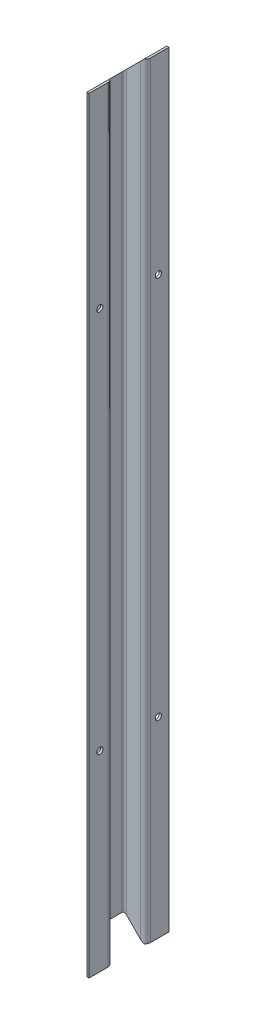
ISO-10303-21;
HEADER;
FILE_DESCRIPTION(('STEP AP214'),'2;1');
FILE_NAME('part.step','',(''),(''),'','','');
FILE_SCHEMA(('AUTOMOTIVE_DESIGN { 1 0 10303 214 1 1 1 1 }'));
ENDSEC;
DATA;
#1=APPLICATION_CONTEXT('core data for automotive mechanical design processes');
#2=APPLICATION_PROTOCOL_DEFINITION('international standard','automotive_design',2000,#1);
#3=PRODUCT_CONTEXT('',#1,'mechanical');
#4=PRODUCT('Part','Part','',(#3));
#5=PRODUCT_RELATED_PRODUCT_CATEGORY('part','',(#4));
#6=PRODUCT_DEFINITION_FORMATION('','',#4);
#7=PRODUCT_DEFINITION_CONTEXT('part definition',#1,'design');
#8=PRODUCT_DEFINITION('design','',#6,#7);
#9=PRODUCT_DEFINITION_SHAPE('','',#8);
#10=(LENGTH_UNIT() NAMED_UNIT(*) SI_UNIT(.MILLI.,.METRE.));
#11=(NAMED_UNIT(*) PLANE_ANGLE_UNIT() SI_UNIT($,.RADIAN.));
#12=(NAMED_UNIT(*) SI_UNIT($,.STERADIAN.) SOLID_ANGLE_UNIT());
#13=UNCERTAINTY_MEASURE_WITH_UNIT(LENGTH_MEASURE(1.E-05),#10,'distance_accuracy_value','');
#14=(GEOMETRIC_REPRESENTATION_CONTEXT(3) GLOBAL_UNCERTAINTY_ASSIGNED_CONTEXT((#13)) GLOBAL_UNIT_ASSIGNED_CONTEXT((#10,
#11,#12)) REPRESENTATION_CONTEXT('',''));
#15=CARTESIAN_POINT('',(0.,0.,0.));
#16=DIRECTION('',(0.,0.,1.));
#17=DIRECTION('',(1.,0.,0.));
#18=AXIS2_PLACEMENT_3D('',#15,#16,#17);
#19=CARTESIAN_POINT('',(12.7,-914.4,-450.975716114044));
#20=DIRECTION('',(0.,0.,1.));
#21=DIRECTION('',(1.,0.,0.));
#22=AXIS2_PLACEMENT_3D('',#19,#20,#21);
#23=PLANE('',#22);
#24=DIRECTION('',(-0.707106781186547,0.707106781186548,0.));
#25=VECTOR('',#24,1.);
#26=CARTESIAN_POINT('',(11.5321843035207,-900.532184303521,-450.975716114044));
#27=LINE('',#26,#25);
#28=CARTESIAN_POINT('',(22.8092,-911.8092,-450.975716114044));
#29=VERTEX_POINT('',#28);
#30=CARTESIAN_POINT('',(5.7658,-894.7658,-450.975716114044));
#31=VERTEX_POINT('',#30);
#32=EDGE_CURVE('E371',#29,#31,#27,.T.);
#33=ORIENTED_EDGE('',*,*,#32,.F.);
#34=DIRECTION('',(0.,1.,0.));
#35=VECTOR('',#34,1.);
#36=CARTESIAN_POINT('',(22.8092,0.,-450.975716114044));
#37=LINE('',#36,#35);
#38=CARTESIAN_POINT('',(22.8092,-2.5908,-450.975716114044));
#39=VERTEX_POINT('',#38);
#40=EDGE_CURVE('E294',#29,#39,#37,.T.);
#41=ORIENTED_EDGE('',*,*,#40,.T.);
#42=DIRECTION('',(-0.707106781186548,-0.707106781186548,0.));
#43=VECTOR('',#42,1.);
#44=CARTESIAN_POINT('',(7.8140222492642,-17.5859777507358,-450.975716114044));
#45=LINE('',#44,#43);
#46=CARTESIAN_POINT('',(5.7658,-19.6342,-450.975716114044));
#47=VERTEX_POINT('',#46);
#48=EDGE_CURVE('E359',#39,#47,#45,.T.);
#49=ORIENTED_EDGE('',*,*,#48,.T.);
#50=DIRECTION('',(0.,1.,0.));
#51=VECTOR('',#50,1.);
#52=CARTESIAN_POINT('',(5.7658,-914.4,-450.975716114044));
#53=LINE('',#52,#51);
#54=EDGE_CURVE('E242',#47,#31,#53,.F.);
#55=ORIENTED_EDGE('',*,*,#54,.T.);
#56=EDGE_LOOP('',(#33,#41,#49,#55));
#57=FACE_BOUND('',#56,.T.);
#58=ADVANCED_FACE('F14',(#57),#23,.T.);
#59=CARTESIAN_POINT('',(0.,-914.4,-473.200716114044));
#60=DIRECTION('',(1.,0.,0.));
#61=DIRECTION('',(0.,0.,-1.));
#62=AXIS2_PLACEMENT_3D('',#59,#60,#61);
#63=PLANE('',#62);
#64=DIRECTION('',(0.,1.,0.));
#65=VECTOR('',#64,1.);
#66=CARTESIAN_POINT('',(0.,0.,-456.741516114044));
#67=LINE('',#66,#65);
#68=CARTESIAN_POINT('',(0.,-889.,-456.741516114044));
#69=VERTEX_POINT('',#68);
#70=CARTESIAN_POINT('',(0.,-25.4,-456.741516114044));
#71=VERTEX_POINT('',#70);
#72=EDGE_CURVE('E480',#69,#71,#67,.T.);
#73=ORIENTED_EDGE('',*,*,#72,.T.);
#74=DIRECTION('',(0.,0.,-1.));
#75=VECTOR('',#74,1.);
#76=CARTESIAN_POINT('',(0.,-25.4,-450.975716114044));
#77=LINE('',#76,#75);
#78=CARTESIAN_POINT('',(0.,-25.4,-489.659916114044));
#79=VERTEX_POINT('',#78);
#80=EDGE_CURVE('E362',#71,#79,#77,.T.);
#81=ORIENTED_EDGE('',*,*,#80,.T.);
#82=DIRECTION('',(0.,1.,0.));
#83=VECTOR('',#82,1.);
#84=CARTESIAN_POINT('',(0.,-914.4,-489.659916114044));
#85=LINE('',#84,#83);
#86=CARTESIAN_POINT('',(0.,-889.,-489.659916114044));
#87=VERTEX_POINT('',#86);
#88=EDGE_CURVE('E476',#79,#87,#85,.F.);
#89=ORIENTED_EDGE('',*,*,#88,.T.);
#90=DIRECTION('',(0.,0.,-1.));
#91=VECTOR('',#90,1.);
#92=CARTESIAN_POINT('',(0.,-889.,-450.975716114044));
#93=LINE('',#92,#91);
#94=EDGE_CURVE('E374',#69,#87,#93,.T.);
#95=ORIENTED_EDGE('',*,*,#94,.F.);
#96=EDGE_LOOP('',(#73,#81,#89,#95));
#97=FACE_BOUND('',#96,.T.);
#98=ADVANCED_FACE('F533',(#97),#63,.F.);
#99=CARTESIAN_POINT('',(12.7,-914.4,-495.425716114044));
#100=DIRECTION('',(0.,0.,1.));
#101=DIRECTION('',(1.,0.,0.));
#102=AXIS2_PLACEMENT_3D('',#99,#100,#101);
#103=PLANE('',#102);
#104=DIRECTION('',(-0.707106781186548,-0.707106781186548,0.));
#105=VECTOR('',#104,1.);
#106=CARTESIAN_POINT('',(7.8140222492642,-17.5859777507358,-495.425716114044));
#107=LINE('',#106,#105);
#108=CARTESIAN_POINT('',(22.8092,-2.5908,-495.425716114044));
#109=VERTEX_POINT('',#108);
#110=CARTESIAN_POINT('',(5.7658,-19.6342,-495.425716114044));
#111=VERTEX_POINT('',#110);
#112=EDGE_CURVE('E232',#109,#111,#107,.T.);
#113=ORIENTED_EDGE('',*,*,#112,.F.);
#114=DIRECTION('',(0.,1.,0.));
#115=VECTOR('',#114,1.);
#116=CARTESIAN_POINT('',(22.8092,-914.4,-495.425716114044));
#117=LINE('',#116,#115);
#118=CARTESIAN_POINT('',(22.8092,-911.8092,-495.425716114044));
#119=VERTEX_POINT('',#118);
#120=EDGE_CURVE('E277',#109,#119,#117,.F.);
#121=ORIENTED_EDGE('',*,*,#120,.T.);
#122=DIRECTION('',(-0.707106781186547,0.707106781186548,0.));
#123=VECTOR('',#122,1.);
#124=CARTESIAN_POINT('',(11.5321843035207,-900.532184303521,-495.425716114044));
#125=LINE('',#124,#123);
#126=CARTESIAN_POINT('',(5.7658,-894.7658,-495.425716114044));
#127=VERTEX_POINT('',#126);
#128=EDGE_CURVE('E327',#119,#127,#125,.T.);
#129=ORIENTED_EDGE('',*,*,#128,.T.);
#130=DIRECTION('',(0.,1.,0.));
#131=VECTOR('',#130,1.);
#132=CARTESIAN_POINT('',(5.7658,-914.4,-495.425716114044));
#133=LINE('',#132,#131);
#134=EDGE_CURVE('E249',#127,#111,#133,.T.);
#135=ORIENTED_EDGE('',*,*,#134,.T.);
#136=EDGE_LOOP('',(#113,#121,#129,#135));
#137=FACE_BOUND('',#136,.T.);
#138=ADVANCED_FACE('F524',(#137),#103,.F.);
#139=CARTESIAN_POINT('',(26.6954,-914.4,-492.824756114044));
#140=DIRECTION('',(0.,0.,1.));
#141=DIRECTION('',(1.,0.,0.));
#142=AXIS2_PLACEMENT_3D('',#139,#140,#141);
#143=PLANE('',#142);
#144=DIRECTION('',(0.707106781186548,0.707106781186547,0.));
#145=VECTOR('',#144,1.);
#146=CARTESIAN_POINT('',(-431.1523,-456.5523,-492.824756114044));
#147=LINE('',#146,#145);
#148=CARTESIAN_POINT('',(5.19175999999988,-20.20824,-492.824756114044));
#149=VERTEX_POINT('',#148);
#150=CARTESIAN_POINT('',(22.225,-3.17499999999988,-492.824756114044));
#151=VERTEX_POINT('',#150);
#152=EDGE_CURVE('E407',#149,#151,#147,.T.);
#153=ORIENTED_EDGE('',*,*,#152,.F.);
#154=DIRECTION('',(0.,1.,0.));
#155=VECTOR('',#154,1.);
#156=CARTESIAN_POINT('',(5.19176,-891.60096,-492.824756114044));
#157=LINE('',#156,#155);
#158=CARTESIAN_POINT('',(5.19176,-894.19176,-492.824756114044));
#159=VERTEX_POINT('',#158);
#160=EDGE_CURVE('E287',#149,#159,#157,.F.);
#161=ORIENTED_EDGE('',*,*,#160,.T.);
#162=DIRECTION('',(0.707106781186547,-0.707106781186548,0.));
#163=VECTOR('',#162,1.);
#164=CARTESIAN_POINT('',(26.0477,-915.0477,-492.824756114044));
#165=LINE('',#164,#163);
#166=CARTESIAN_POINT('',(22.225,-911.225,-492.824756114044));
#167=VERTEX_POINT('',#166);
#168=EDGE_CURVE('E385',#159,#167,#165,.T.);
#169=ORIENTED_EDGE('',*,*,#168,.T.);
#170=DIRECTION('',(0.,1.,0.));
#171=VECTOR('',#170,1.);
#172=CARTESIAN_POINT('',(22.225,-914.4,-492.824756114044));
#173=LINE('',#172,#171);
#174=EDGE_CURVE('E260',#167,#151,#173,.T.);
#175=ORIENTED_EDGE('',*,*,#174,.T.);
#176=EDGE_LOOP('',(#153,#161,#169,#175));
#177=FACE_BOUND('',#176,.T.);
#178=ADVANCED_FACE('F625',(#177),#143,.T.);
#179=CARTESIAN_POINT('',(2.60096,-914.4,-473.200716114044));
#180=DIRECTION('',(1.,0.,0.));
#181=DIRECTION('',(0.,0.,-1.));
#182=AXIS2_PLACEMENT_3D('',#179,#180,#181);
#183=PLANE('',#182);
#184=DIRECTION('',(0.,0.,-1.));
#185=VECTOR('',#184,1.);
#186=CARTESIAN_POINT('',(2.60096,-891.60096,-473.200716114044));
#187=LINE('',#186,#185);
#188=CARTESIAN_POINT('',(2.60096,-891.60096,-456.167476114044));
#189=VERTEX_POINT('',#188);
#190=CARTESIAN_POINT('',(2.60096,-891.60096,-490.233956114044));
#191=VERTEX_POINT('',#190);
#192=EDGE_CURVE('E381',#189,#191,#187,.T.);
#193=ORIENTED_EDGE('',*,*,#192,.T.);
#194=DIRECTION('',(0.,1.,0.));
#195=VECTOR('',#194,1.);
#196=CARTESIAN_POINT('',(2.60096,-22.79904,-490.233956114044));
#197=LINE('',#196,#195);
#198=CARTESIAN_POINT('',(2.60096,-22.79904,-490.233956114044));
#199=VERTEX_POINT('',#198);
#200=EDGE_CURVE('E283',#191,#199,#197,.T.);
#201=ORIENTED_EDGE('',*,*,#200,.T.);
#202=DIRECTION('',(0.,0.,-1.));
#203=VECTOR('',#202,1.);
#204=CARTESIAN_POINT('',(2.60096,-22.79904,-473.200716114044));
#205=LINE('',#204,#203);
#206=CARTESIAN_POINT('',(2.60096,-22.79904,-456.167476114044));
#207=VERTEX_POINT('',#206);
#208=EDGE_CURVE('E403',#207,#199,#205,.T.);
#209=ORIENTED_EDGE('',*,*,#208,.F.);
#210=DIRECTION('',(0.,1.,0.));
#211=VECTOR('',#210,1.);
#212=CARTESIAN_POINT('',(2.60096,-914.4,-456.167476114044));
#213=LINE('',#212,#211);
#214=EDGE_CURVE('E280',#207,#189,#213,.F.);
#215=ORIENTED_EDGE('',*,*,#214,.T.);
#216=EDGE_LOOP('',(#193,#201,#209,#215));
#217=FACE_BOUND('',#216,.T.);
#218=ADVANCED_FACE('F619',(#217),#183,.T.);
#219=CARTESIAN_POINT('',(14.00048,-914.4,-453.576676114044));
#220=DIRECTION('',(0.,0.,1.));
#221=DIRECTION('',(1.,0.,0.));
#222=AXIS2_PLACEMENT_3D('',#219,#220,#221);
#223=PLANE('',#222);
#224=DIRECTION('',(0.707106781186547,-0.707106781186548,0.));
#225=VECTOR('',#224,1.);
#226=CARTESIAN_POINT('',(19.70024,-908.70024,-453.576676114044));
#227=LINE('',#226,#225);
#228=CARTESIAN_POINT('',(5.19176,-894.19176,-453.576676114044));
#229=VERTEX_POINT('',#228);
#230=CARTESIAN_POINT('',(22.225,-911.225,-453.576676114044));
#231=VERTEX_POINT('',#230);
#232=EDGE_CURVE('E213',#229,#231,#227,.T.);
#233=ORIENTED_EDGE('',*,*,#232,.F.);
#234=DIRECTION('',(0.,1.,0.));
#235=VECTOR('',#234,1.);
#236=CARTESIAN_POINT('',(5.19176,-914.4,-453.576676114044));
#237=LINE('',#236,#235);
#238=CARTESIAN_POINT('',(5.19175999999988,-20.20824,-453.576676114044));
#239=VERTEX_POINT('',#238);
#240=EDGE_CURVE('E290',#229,#239,#237,.T.);
#241=ORIENTED_EDGE('',*,*,#240,.T.);
#242=DIRECTION('',(0.707106781186548,0.707106781186547,0.));
#243=VECTOR('',#242,1.);
#244=CARTESIAN_POINT('',(-437.49976,-462.89976,-453.576676114044));
#245=LINE('',#244,#243);
#246=CARTESIAN_POINT('',(22.225,-3.17499999999982,-453.576676114044));
#247=VERTEX_POINT('',#246);
#248=EDGE_CURVE('E400',#239,#247,#245,.T.);
#249=ORIENTED_EDGE('',*,*,#248,.T.);
#250=DIRECTION('',(0.,1.,0.));
#251=VECTOR('',#250,1.);
#252=CARTESIAN_POINT('',(22.225,-914.4,-453.576676114044));
#253=LINE('',#252,#251);
#254=EDGE_CURVE('E220',#247,#231,#253,.F.);
#255=ORIENTED_EDGE('',*,*,#254,.T.);
#256=EDGE_LOOP('',(#233,#241,#249,#255));
#257=FACE_BOUND('',#256,.T.);
#258=ADVANCED_FACE('F615',(#257),#223,.F.);
#259=CARTESIAN_POINT('',(13.9954,-914.4,-473.200716114044));
#260=DIRECTION('',(0.,-1.,0.));
#261=DIRECTION('',(1.,0.,0.));
#262=AXIS2_PLACEMENT_3D('',#259,#260,#261);
#263=PLANE('',#262);
#264=DIRECTION('',(0.,0.,1.));
#265=VECTOR('',#264,1.);
#266=CARTESIAN_POINT('',(25.4,-914.4,-438.275716114044));
#267=LINE('',#266,#265);
#268=CARTESIAN_POINT('',(25.4,-914.4,-448.384916114044));
#269=VERTEX_POINT('',#268);
#270=CARTESIAN_POINT('',(25.4,-914.4,-425.575716114044));
#271=VERTEX_POINT('',#270);
#272=EDGE_CURVE('E229',#269,#271,#267,.T.);
#273=ORIENTED_EDGE('',*,*,#272,.F.);
#274=DIRECTION('',(0.,0.,-1.));
#275=VECTOR('',#274,1.);
#276=CARTESIAN_POINT('',(25.4,-914.4,-450.975716114044));
#277=LINE('',#276,#275);
#278=CARTESIAN_POINT('',(25.4,-914.4,-452.623757230382));
#279=VERTEX_POINT('',#278);
#280=EDGE_CURVE('E210',#269,#279,#277,.T.);
#281=ORIENTED_EDGE('',*,*,#280,.T.);
#282=CARTESIAN_POINT('',(22.225,-914.4,-447.810876114044));
#283=DIRECTION('',(0.,-1.,0.));
#284=DIRECTION('',(0.,0.,-1.));
#285=AXIS2_PLACEMENT_3D('',#282,#283,#284);
#286=CIRCLE('',#285,5.7658);
#287=CARTESIAN_POINT('',(27.9908,-914.4,-447.810876114044));
#288=VERTEX_POINT('',#287);
#289=EDGE_CURVE('E226',#279,#288,#286,.T.);
#290=ORIENTED_EDGE('',*,*,#289,.T.);
#291=DIRECTION('',(0.,0.,-1.));
#292=VECTOR('',#291,1.);
#293=CARTESIAN_POINT('',(27.9908,-914.4,-439.576196114044));
#294=LINE('',#293,#292);
#295=CARTESIAN_POINT('',(27.9908,-914.4,-425.575716114044));
#296=VERTEX_POINT('',#295);
#297=EDGE_CURVE('E433',#296,#288,#294,.T.);
#298=ORIENTED_EDGE('',*,*,#297,.F.);
#299=DIRECTION('',(1.,0.,0.));
#300=VECTOR('',#299,1.);
#301=CARTESIAN_POINT('',(26.6954,-914.4,-425.575716114044));
#302=LINE('',#301,#300);
#303=EDGE_CURVE('E436',#271,#296,#302,.T.);
#304=ORIENTED_EDGE('',*,*,#303,.F.);
#305=EDGE_LOOP('',(#273,#281,#290,#298,#304));
#306=FACE_BOUND('',#305,.T.);
#307=ADVANCED_FACE('F224',(#306),#263,.T.);
#308=CARTESIAN_POINT('',(22.225,-914.4,-498.590556114044));
#309=DIRECTION('',(0.,-1.,0.));
#310=DIRECTION('',(0.,0.,-1.));
#311=AXIS2_PLACEMENT_3D('',#308,#309,#310);
#312=CIRCLE('',#311,5.7658);
#313=CARTESIAN_POINT('',(27.9908,-914.4,-498.590556114044));
#314=VERTEX_POINT('',#313);
#315=CARTESIAN_POINT('',(25.4,-914.4,-493.777674997707));
#316=VERTEX_POINT('',#315);
#317=EDGE_CURVE('E241',#314,#316,#312,.T.);
#318=ORIENTED_EDGE('',*,*,#317,.T.);
#319=CARTESIAN_POINT('',(25.4,-914.4,-498.016516114044));
#320=VERTEX_POINT('',#319);
#321=EDGE_CURVE('E233',#316,#320,#277,.T.);
#322=ORIENTED_EDGE('',*,*,#321,.T.);
#323=DIRECTION('',(0.,0.,1.));
#324=VECTOR('',#323,1.);
#325=CARTESIAN_POINT('',(25.4,-914.4,-508.125716114044));
#326=LINE('',#325,#324);
#327=CARTESIAN_POINT('',(25.4,-914.4,-520.825716114044));
#328=VERTEX_POINT('',#327);
#329=EDGE_CURVE('E421',#328,#320,#326,.T.);
#330=ORIENTED_EDGE('',*,*,#329,.F.);
#331=DIRECTION('',(-1.,0.,0.));
#332=VECTOR('',#331,1.);
#333=CARTESIAN_POINT('',(26.6954,-914.4,-520.825716114044));
#334=LINE('',#333,#332);
#335=CARTESIAN_POINT('',(27.9908,-914.4,-520.825716114044));
#336=VERTEX_POINT('',#335);
#337=EDGE_CURVE('E425',#336,#328,#334,.T.);
#338=ORIENTED_EDGE('',*,*,#337,.F.);
#339=DIRECTION('',(0.,0.,-1.));
#340=VECTOR('',#339,1.);
#341=CARTESIAN_POINT('',(27.9908,-914.4,-506.825236114044));
#342=LINE('',#341,#340);
#343=EDGE_CURVE('E430',#314,#336,#342,.T.);
#344=ORIENTED_EDGE('',*,*,#343,.F.);
#345=EDGE_LOOP('',(#318,#322,#330,#338,#344));
#346=FACE_BOUND('',#345,.T.);
#347=ADVANCED_FACE('F505',(#346),#263,.T.);
#348=CARTESIAN_POINT('',(13.9954,0.,-473.200716114044));
#349=DIRECTION('',(0.,-1.,0.));
#350=DIRECTION('',(1.,0.,0.));
#351=AXIS2_PLACEMENT_3D('',#348,#349,#350);
#352=PLANE('',#351);
#353=DIRECTION('',(0.,0.,-1.));
#354=VECTOR('',#353,1.);
#355=CARTESIAN_POINT('',(25.4,0.,-450.975716114044));
#356=LINE('',#355,#354);
#357=CARTESIAN_POINT('',(25.4,0.,-448.384916114044));
#358=VERTEX_POINT('',#357);
#359=CARTESIAN_POINT('',(25.4,0.,-452.623757230382));
#360=VERTEX_POINT('',#359);
#361=EDGE_CURVE('E38',#358,#360,#356,.T.);
#362=ORIENTED_EDGE('',*,*,#361,.F.);
#363=DIRECTION('',(0.,0.,1.));
#364=VECTOR('',#363,1.);
#365=CARTESIAN_POINT('',(25.4,0.,-438.275716114044));
#366=LINE('',#365,#364);
#367=CARTESIAN_POINT('',(25.4,0.,-425.575716114044));
#368=VERTEX_POINT('',#367);
#369=EDGE_CURVE('E426',#358,#368,#366,.T.);
#370=ORIENTED_EDGE('',*,*,#369,.T.);
#371=DIRECTION('',(1.,0.,0.));
#372=VECTOR('',#371,1.);
#373=CARTESIAN_POINT('',(26.6954,0.,-425.575716114044));
#374=LINE('',#373,#372);
#375=CARTESIAN_POINT('',(27.9908,0.,-425.575716114044));
#376=VERTEX_POINT('',#375);
#377=EDGE_CURVE('E457',#368,#376,#374,.T.);
#378=ORIENTED_EDGE('',*,*,#377,.T.);
#379=DIRECTION('',(0.,0.,-1.));
#380=VECTOR('',#379,1.);
#381=CARTESIAN_POINT('',(27.9908,0.,-439.576196114044));
#382=LINE('',#381,#380);
#383=CARTESIAN_POINT('',(27.9908,0.,-447.810876114044));
#384=VERTEX_POINT('',#383);
#385=EDGE_CURVE('E453',#376,#384,#382,.T.);
#386=ORIENTED_EDGE('',*,*,#385,.T.);
#387=CARTESIAN_POINT('',(22.225,0.,-447.810876114044));
#388=DIRECTION('',(0.,-1.,0.));
#389=DIRECTION('',(0.,0.,-1.));
#390=AXIS2_PLACEMENT_3D('',#387,#388,#389);
#391=CIRCLE('',#390,5.7658);
#392=EDGE_CURVE('E484',#384,#360,#391,.F.);
#393=ORIENTED_EDGE('',*,*,#392,.T.);
#394=EDGE_LOOP('',(#362,#370,#378,#386,#393));
#395=FACE_BOUND('',#394,.T.);
#396=ADVANCED_FACE('F562',(#395),#352,.F.);
#397=CARTESIAN_POINT('',(25.4,0.,-493.777674997706));
#398=VERTEX_POINT('',#397);
#399=CARTESIAN_POINT('',(25.4,0.,-498.016516114044));
#400=VERTEX_POINT('',#399);
#401=EDGE_CURVE('E368',#398,#400,#356,.T.);
#402=ORIENTED_EDGE('',*,*,#401,.F.);
#403=CARTESIAN_POINT('',(22.225,0.,-498.590556114044));
#404=DIRECTION('',(0.,-1.,0.));
#405=DIRECTION('',(0.,0.,-1.));
#406=AXIS2_PLACEMENT_3D('',#403,#404,#405);
#407=CIRCLE('',#406,5.7658);
#408=CARTESIAN_POINT('',(27.9908,0.,-498.590556114044));
#409=VERTEX_POINT('',#408);
#410=EDGE_CURVE('E253',#398,#409,#407,.F.);
#411=ORIENTED_EDGE('',*,*,#410,.T.);
#412=DIRECTION('',(0.,0.,-1.));
#413=VECTOR('',#412,1.);
#414=CARTESIAN_POINT('',(27.9908,0.,-506.825236114044));
#415=LINE('',#414,#413);
#416=CARTESIAN_POINT('',(27.9908,0.,-520.825716114044));
#417=VERTEX_POINT('',#416);
#418=EDGE_CURVE('E450',#409,#417,#415,.T.);
#419=ORIENTED_EDGE('',*,*,#418,.T.);
#420=DIRECTION('',(-1.,0.,0.));
#421=VECTOR('',#420,1.);
#422=CARTESIAN_POINT('',(26.6954,0.,-520.825716114044));
#423=LINE('',#422,#421);
#424=CARTESIAN_POINT('',(25.4,0.,-520.825716114044));
#425=VERTEX_POINT('',#424);
#426=EDGE_CURVE('E446',#417,#425,#423,.T.);
#427=ORIENTED_EDGE('',*,*,#426,.T.);
#428=DIRECTION('',(0.,0.,1.));
#429=VECTOR('',#428,1.);
#430=CARTESIAN_POINT('',(25.4,0.,-508.125716114044));
#431=LINE('',#430,#429);
#432=EDGE_CURVE('E420',#425,#400,#431,.T.);
#433=ORIENTED_EDGE('',*,*,#432,.T.);
#434=EDGE_LOOP('',(#402,#411,#419,#427,#433));
#435=FACE_BOUND('',#434,.T.);
#436=ADVANCED_FACE('F491',(#435),#352,.F.);
#437=CARTESIAN_POINT('',(5.7658,-914.4,-456.741516114044));
#438=DIRECTION('',(0.,-1.,0.));
#439=DIRECTION('',(0.,0.,-1.));
#440=AXIS2_PLACEMENT_3D('',#437,#438,#439);
#441=CYLINDRICAL_SURFACE('',#440,5.7658);
#442=CARTESIAN_POINT('',(5.7658,-19.6342,-456.741516114044));
#443=DIRECTION('',(0.707106781186547,-0.707106781186548,0.));
#444=DIRECTION('',(-0.707106781186548,-0.707106781186548,0.));
#445=AXIS2_PLACEMENT_3D('',#442,#443,#444);
#446=ELLIPSE('',#445,8.15407255793079,5.7658);
#447=EDGE_CURVE('E416',#71,#47,#446,.F.);
#448=ORIENTED_EDGE('',*,*,#447,.F.);
#449=ORIENTED_EDGE('',*,*,#72,.F.);
#450=CARTESIAN_POINT('',(5.7658,-894.7658,-456.741516114044));
#451=DIRECTION('',(-0.707106781186548,-0.707106781186547,0.));
#452=DIRECTION('',(0.707106781186547,-0.707106781186548,0.));
#453=AXIS2_PLACEMENT_3D('',#450,#451,#452);
#454=ELLIPSE('',#453,8.1540725579308,5.7658);
#455=EDGE_CURVE('E396',#69,#31,#454,.F.);
#456=ORIENTED_EDGE('',*,*,#455,.T.);
#457=ORIENTED_EDGE('',*,*,#54,.F.);
#458=EDGE_LOOP('',(#448,#449,#456,#457));
#459=FACE_BOUND('',#458,.T.);
#460=ADVANCED_FACE('F537',(#459),#441,.T.);
#461=CARTESIAN_POINT('',(5.7658,-914.4,-489.659916114044));
#462=DIRECTION('',(0.,1.,0.));
#463=DIRECTION('',(0.,0.,1.));
#464=AXIS2_PLACEMENT_3D('',#461,#462,#463);
#465=CYLINDRICAL_SURFACE('',#464,5.7658);
#466=CARTESIAN_POINT('',(5.7658,-19.6342,-489.659916114044));
#467=DIRECTION('',(0.707106781186547,-0.707106781186548,0.));
#468=DIRECTION('',(0.707106781186548,0.707106781186548,0.));
#469=AXIS2_PLACEMENT_3D('',#466,#467,#468);
#470=ELLIPSE('',#469,8.15407255793079,5.7658);
#471=EDGE_CURVE('E413',#111,#79,#470,.F.);
#472=ORIENTED_EDGE('',*,*,#471,.F.);
#473=ORIENTED_EDGE('',*,*,#134,.F.);
#474=CARTESIAN_POINT('',(5.7658,-894.7658,-489.659916114044));
#475=DIRECTION('',(-0.707106781186548,-0.707106781186547,0.));
#476=DIRECTION('',(-0.707106781186547,0.707106781186548,0.));
#477=AXIS2_PLACEMENT_3D('',#474,#475,#476);
#478=ELLIPSE('',#477,8.1540725579308,5.7658);
#479=EDGE_CURVE('E392',#127,#87,#478,.F.);
#480=ORIENTED_EDGE('',*,*,#479,.T.);
#481=ORIENTED_EDGE('',*,*,#88,.F.);
#482=EDGE_LOOP('',(#472,#473,#480,#481));
#483=FACE_BOUND('',#482,.T.);
#484=ADVANCED_FACE('F529',(#483),#465,.T.);
#485=CARTESIAN_POINT('',(22.225,-914.4,-498.590556114044));
#486=DIRECTION('',(0.,1.,0.));
#487=DIRECTION('',(0.,0.,1.));
#488=AXIS2_PLACEMENT_3D('',#485,#486,#487);
#489=CYLINDRICAL_SURFACE('',#488,5.7658);
#490=CARTESIAN_POINT('',(22.225,-3.17499999999982,-498.590556114044));
#491=DIRECTION('',(0.707106781186547,-0.707106781186548,0.));
#492=DIRECTION('',(0.707106781186548,0.707106781186548,0.));
#493=AXIS2_PLACEMENT_3D('',#490,#491,#492);
#494=ELLIPSE('',#493,8.15407255793079,5.7658);
#495=EDGE_CURVE('E410',#151,#398,#494,.F.);
#496=ORIENTED_EDGE('',*,*,#495,.F.);
#497=ORIENTED_EDGE('',*,*,#174,.F.);
#498=CARTESIAN_POINT('',(22.225,-911.225,-498.590556114044));
#499=DIRECTION('',(-0.707106781186548,-0.707106781186547,0.));
#500=DIRECTION('',(-0.707106781186547,0.707106781186548,0.));
#501=AXIS2_PLACEMENT_3D('',#498,#499,#500);
#502=ELLIPSE('',#501,8.1540725579308,5.7658);
#503=EDGE_CURVE('E388',#167,#316,#502,.F.);
#504=ORIENTED_EDGE('',*,*,#503,.T.);
#505=ORIENTED_EDGE('',*,*,#317,.F.);
#506=DIRECTION('',(0.,1.,0.));
#507=VECTOR('',#506,1.);
#508=CARTESIAN_POINT('',(27.9908,-914.4,-498.590556114044));
#509=LINE('',#508,#507);
#510=EDGE_CURVE('E264',#409,#314,#509,.F.);
#511=ORIENTED_EDGE('',*,*,#510,.F.);
#512=ORIENTED_EDGE('',*,*,#410,.F.);
#513=EDGE_LOOP('',(#496,#497,#504,#505,#511,#512));
#514=FACE_BOUND('',#513,.T.);
#515=ADVANCED_FACE('F501',(#514),#489,.T.);
#516=CARTESIAN_POINT('',(22.225,-914.4,-447.810876114044));
#517=DIRECTION('',(0.,-1.,0.));
#518=DIRECTION('',(0.,0.,-1.));
#519=AXIS2_PLACEMENT_3D('',#516,#517,#518);
#520=CYLINDRICAL_SURFACE('',#519,5.7658);
#521=CARTESIAN_POINT('',(22.225,-3.17499999999982,-447.810876114044));
#522=DIRECTION('',(0.707106781186547,-0.707106781186548,0.));
#523=DIRECTION('',(-0.707106781186548,-0.707106781186548,0.));
#524=AXIS2_PLACEMENT_3D('',#521,#522,#523);
#525=ELLIPSE('',#524,8.15407255793079,5.7658);
#526=EDGE_CURVE('E219',#360,#247,#525,.F.);
#527=ORIENTED_EDGE('',*,*,#526,.F.);
#528=ORIENTED_EDGE('',*,*,#392,.F.);
#529=DIRECTION('',(0.,1.,0.));
#530=VECTOR('',#529,1.);
#531=CARTESIAN_POINT('',(27.9908,0.,-447.810876114044));
#532=LINE('',#531,#530);
#533=EDGE_CURVE('E239',#288,#384,#532,.T.);
#534=ORIENTED_EDGE('',*,*,#533,.F.);
#535=ORIENTED_EDGE('',*,*,#289,.F.);
#536=CARTESIAN_POINT('',(22.225,-911.225,-447.810876114044));
#537=DIRECTION('',(-0.707106781186548,-0.707106781186547,0.));
#538=DIRECTION('',(0.707106781186547,-0.707106781186548,0.));
#539=AXIS2_PLACEMENT_3D('',#536,#537,#538);
#540=ELLIPSE('',#539,8.1540725579308,5.7658);
#541=EDGE_CURVE('E207',#279,#231,#540,.F.);
#542=ORIENTED_EDGE('',*,*,#541,.T.);
#543=ORIENTED_EDGE('',*,*,#254,.F.);
#544=EDGE_LOOP('',(#527,#528,#534,#535,#542,#543));
#545=FACE_BOUND('',#544,.T.);
#546=ADVANCED_FACE('F237',(#545),#520,.T.);
#547=CARTESIAN_POINT('',(25.4,-914.4,-508.125716114044));
#548=DIRECTION('',(-1.,0.,0.));
#549=DIRECTION('',(0.,0.,1.));
#550=AXIS2_PLACEMENT_3D('',#547,#548,#549);
#551=PLANE('',#550);
#552=CARTESIAN_POINT('',(25.4,-228.6,-508.125716114044));
#553=DIRECTION('',(-1.,0.,0.));
#554=DIRECTION('',(0.,0.,1.));
#555=AXIS2_PLACEMENT_3D('',#552,#553,#554);
#556=CIRCLE('',#555,3.683);
#557=CARTESIAN_POINT('',(25.4,-228.6,-504.442716114044));
#558=VERTEX_POINT('',#557);
#559=EDGE_CURVE('E333',#558,#558,#556,.F.);
#560=ORIENTED_EDGE('',*,*,#559,.T.);
#561=EDGE_LOOP('',(#560));
#562=FACE_BOUND('',#561,.T.);
#563=CARTESIAN_POINT('',(25.4,-685.8,-508.125716114044));
#564=DIRECTION('',(-1.,0.,0.));
#565=DIRECTION('',(0.,0.,1.));
#566=AXIS2_PLACEMENT_3D('',#563,#564,#565);
#567=CIRCLE('',#566,3.683);
#568=CARTESIAN_POINT('',(25.4,-685.8,-504.442716114044));
#569=VERTEX_POINT('',#568);
#570=EDGE_CURVE('E329',#569,#569,#567,.F.);
#571=ORIENTED_EDGE('',*,*,#570,.T.);
#572=EDGE_LOOP('',(#571));
#573=FACE_BOUND('',#572,.T.);
#574=ORIENTED_EDGE('',*,*,#329,.T.);
#575=DIRECTION('',(0.,1.,0.));
#576=VECTOR('',#575,1.);
#577=CARTESIAN_POINT('',(25.4,-914.4,-498.016516114044));
#578=LINE('',#577,#576);
#579=EDGE_CURVE('E273',#320,#400,#578,.T.);
#580=ORIENTED_EDGE('',*,*,#579,.T.);
#581=ORIENTED_EDGE('',*,*,#432,.F.);
#582=DIRECTION('',(0.,1.,0.));
#583=VECTOR('',#582,1.);
#584=CARTESIAN_POINT('',(25.4,-914.4,-520.825716114044));
#585=LINE('',#584,#583);
#586=EDGE_CURVE('E473',#328,#425,#585,.T.);
#587=ORIENTED_EDGE('',*,*,#586,.F.);
#588=EDGE_LOOP('',(#574,#580,#581,#587));
#589=FACE_BOUND('',#588,.T.);
#590=ADVANCED_FACE('F512',(#562,#573,#589),#551,.T.);
#591=CARTESIAN_POINT('',(26.6954,-914.4,-520.825716114044));
#592=DIRECTION('',(0.,0.,-1.));
#593=DIRECTION('',(-1.,0.,0.));
#594=AXIS2_PLACEMENT_3D('',#591,#592,#593);
#595=PLANE('',#594);
#596=ORIENTED_EDGE('',*,*,#426,.F.);
#597=DIRECTION('',(0.,1.,0.));
#598=VECTOR('',#597,1.);
#599=CARTESIAN_POINT('',(27.9908,-914.4,-520.825716114044));
#600=LINE('',#599,#598);
#601=EDGE_CURVE('E469',#336,#417,#600,.T.);
#602=ORIENTED_EDGE('',*,*,#601,.F.);
#603=ORIENTED_EDGE('',*,*,#337,.T.);
#604=ORIENTED_EDGE('',*,*,#586,.T.);
#605=EDGE_LOOP('',(#596,#602,#603,#604));
#606=FACE_BOUND('',#605,.T.);
#607=ADVANCED_FACE('F509',(#606),#595,.T.);
#608=CARTESIAN_POINT('',(27.9908,-914.4,-506.825236114044));
#609=DIRECTION('',(1.,0.,0.));
#610=DIRECTION('',(0.,0.,-1.));
#611=AXIS2_PLACEMENT_3D('',#608,#609,#610);
#612=PLANE('',#611);
#613=CARTESIAN_POINT('',(27.9908,-228.6,-508.125716114044));
#614=DIRECTION('',(1.,0.,0.));
#615=DIRECTION('',(0.,0.,-1.));
#616=AXIS2_PLACEMENT_3D('',#613,#614,#615);
#617=CIRCLE('',#616,3.683);
#618=CARTESIAN_POINT('',(27.9908,-228.6,-511.808716114044));
#619=VERTEX_POINT('',#618);
#620=EDGE_CURVE('E336',#619,#619,#617,.T.);
#621=ORIENTED_EDGE('',*,*,#620,.F.);
#622=EDGE_LOOP('',(#621));
#623=FACE_BOUND('',#622,.T.);
#624=CARTESIAN_POINT('',(27.9908,-685.8,-508.125716114044));
#625=DIRECTION('',(1.,0.,0.));
#626=DIRECTION('',(0.,0.,-1.));
#627=AXIS2_PLACEMENT_3D('',#624,#625,#626);
#628=CIRCLE('',#627,3.683);
#629=CARTESIAN_POINT('',(27.9908,-685.8,-511.808716114044));
#630=VERTEX_POINT('',#629);
#631=EDGE_CURVE('E332',#630,#630,#628,.T.);
#632=ORIENTED_EDGE('',*,*,#631,.F.);
#633=EDGE_LOOP('',(#632));
#634=FACE_BOUND('',#633,.T.);
#635=ORIENTED_EDGE('',*,*,#418,.F.);
#636=ORIENTED_EDGE('',*,*,#510,.T.);
#637=ORIENTED_EDGE('',*,*,#343,.T.);
#638=ORIENTED_EDGE('',*,*,#601,.T.);
#639=EDGE_LOOP('',(#635,#636,#637,#638));
#640=FACE_BOUND('',#639,.T.);
#641=ADVANCED_FACE('F496',(#623,#634,#640),#612,.T.);
#642=CARTESIAN_POINT('',(27.9908,-914.4,-439.576196114044));
#643=DIRECTION('',(1.,0.,0.));
#644=DIRECTION('',(0.,0.,-1.));
#645=AXIS2_PLACEMENT_3D('',#642,#643,#644);
#646=PLANE('',#645);
#647=CARTESIAN_POINT('',(27.9908,-228.6,-438.275716114044));
#648=DIRECTION('',(1.,0.,0.));
#649=DIRECTION('',(0.,0.,-1.));
#650=AXIS2_PLACEMENT_3D('',#647,#648,#649);
#651=CIRCLE('',#650,3.683);
#652=CARTESIAN_POINT('',(27.9908,-228.6,-441.958716114044));
#653=VERTEX_POINT('',#652);
#654=EDGE_CURVE('E353',#653,#653,#651,.T.);
#655=ORIENTED_EDGE('',*,*,#654,.F.);
#656=EDGE_LOOP('',(#655));
#657=FACE_BOUND('',#656,.T.);
#658=CARTESIAN_POINT('',(27.9908,-685.8,-438.275716114044));
#659=DIRECTION('',(1.,0.,0.));
#660=DIRECTION('',(0.,0.,-1.));
#661=AXIS2_PLACEMENT_3D('',#658,#659,#660);
#662=CIRCLE('',#661,3.683);
#663=CARTESIAN_POINT('',(27.9908,-685.8,-441.958716114044));
#664=VERTEX_POINT('',#663);
#665=EDGE_CURVE('E328',#664,#664,#662,.T.);
#666=ORIENTED_EDGE('',*,*,#665,.F.);
#667=EDGE_LOOP('',(#666));
#668=FACE_BOUND('',#667,.T.);
#669=ORIENTED_EDGE('',*,*,#297,.T.);
#670=ORIENTED_EDGE('',*,*,#533,.T.);
#671=ORIENTED_EDGE('',*,*,#385,.F.);
#672=DIRECTION('',(0.,1.,0.));
#673=VECTOR('',#672,1.);
#674=CARTESIAN_POINT('',(27.9908,-914.4,-425.575716114044));
#675=LINE('',#674,#673);
#676=EDGE_CURVE('E466',#296,#376,#675,.T.);
#677=ORIENTED_EDGE('',*,*,#676,.F.);
#678=EDGE_LOOP('',(#669,#670,#671,#677));
#679=FACE_BOUND('',#678,.T.);
#680=ADVANCED_FACE('F567',(#657,#668,#679),#646,.T.);
#681=CARTESIAN_POINT('',(26.6954,-914.4,-425.575716114044));
#682=DIRECTION('',(0.,0.,1.));
#683=DIRECTION('',(1.,0.,0.));
#684=AXIS2_PLACEMENT_3D('',#681,#682,#683);
#685=PLANE('',#684);
#686=ORIENTED_EDGE('',*,*,#377,.F.);
#687=DIRECTION('',(0.,1.,0.));
#688=VECTOR('',#687,1.);
#689=CARTESIAN_POINT('',(25.4,-914.4,-425.575716114044));
#690=LINE('',#689,#688);
#691=EDGE_CURVE('E442',#271,#368,#690,.T.);
#692=ORIENTED_EDGE('',*,*,#691,.F.);
#693=ORIENTED_EDGE('',*,*,#303,.T.);
#694=ORIENTED_EDGE('',*,*,#676,.T.);
#695=EDGE_LOOP('',(#686,#692,#693,#694));
#696=FACE_BOUND('',#695,.T.);
#697=ADVANCED_FACE('F565',(#696),#685,.T.);
#698=CARTESIAN_POINT('',(25.4,-914.4,-438.275716114044));
#699=DIRECTION('',(-1.,0.,0.));
#700=DIRECTION('',(0.,0.,1.));
#701=AXIS2_PLACEMENT_3D('',#698,#699,#700);
#702=PLANE('',#701);
#703=CARTESIAN_POINT('',(25.4,-228.6,-438.275716114044));
#704=DIRECTION('',(-1.,0.,0.));
#705=DIRECTION('',(0.,0.,1.));
#706=AXIS2_PLACEMENT_3D('',#703,#704,#705);
#707=CIRCLE('',#706,3.683);
#708=CARTESIAN_POINT('',(25.4,-228.6,-434.592716114044));
#709=VERTEX_POINT('',#708);
#710=EDGE_CURVE('E18',#709,#709,#707,.F.);
#711=ORIENTED_EDGE('',*,*,#710,.T.);
#712=EDGE_LOOP('',(#711));
#713=FACE_BOUND('',#712,.T.);
#714=CARTESIAN_POINT('',(25.4,-685.8,-438.275716114044));
#715=DIRECTION('',(-1.,0.,0.));
#716=DIRECTION('',(0.,0.,1.));
#717=AXIS2_PLACEMENT_3D('',#714,#715,#716);
#718=CIRCLE('',#717,3.683);
#719=CARTESIAN_POINT('',(25.4,-685.8,-434.592716114044));
#720=VERTEX_POINT('',#719);
#721=EDGE_CURVE('E323',#720,#720,#718,.F.);
#722=ORIENTED_EDGE('',*,*,#721,.T.);
#723=EDGE_LOOP('',(#722));
#724=FACE_BOUND('',#723,.T.);
#725=ORIENTED_EDGE('',*,*,#369,.F.);
#726=DIRECTION('',(0.,1.,0.));
#727=VECTOR('',#726,1.);
#728=CARTESIAN_POINT('',(25.4,-914.4,-448.384916114044));
#729=LINE('',#728,#727);
#730=EDGE_CURVE('E298',#358,#269,#729,.F.);
#731=ORIENTED_EDGE('',*,*,#730,.T.);
#732=ORIENTED_EDGE('',*,*,#272,.T.);
#733=ORIENTED_EDGE('',*,*,#691,.T.);
#734=EDGE_LOOP('',(#725,#731,#732,#733));
#735=FACE_BOUND('',#734,.T.);
#736=ADVANCED_FACE('F546',(#713,#724,#735),#702,.T.);
#737=CARTESIAN_POINT('',(11.5321843035207,-900.532184303521,-450.975716114044));
#738=DIRECTION('',(-0.707106781186548,-0.707106781186547,0.));
#739=DIRECTION('',(0.707106781186547,-0.707106781186548,0.));
#740=AXIS2_PLACEMENT_3D('',#737,#738,#739);
#741=PLANE('',#740);
#742=ORIENTED_EDGE('',*,*,#94,.T.);
#743=ORIENTED_EDGE('',*,*,#479,.F.);
#744=ORIENTED_EDGE('',*,*,#128,.F.);
#745=CARTESIAN_POINT('',(22.8092,-911.8092,-498.016516114044));
#746=DIRECTION('',(-0.707106781186548,-0.707106781186547,0.));
#747=DIRECTION('',(-0.707106781186547,0.707106781186548,0.));
#748=AXIS2_PLACEMENT_3D('',#745,#746,#747);
#749=ELLIPSE('',#748,3.66394449739622,2.5908);
#750=EDGE_CURVE('E304',#119,#320,#749,.F.);
#751=ORIENTED_EDGE('',*,*,#750,.T.);
#752=ORIENTED_EDGE('',*,*,#321,.F.);
#753=ORIENTED_EDGE('',*,*,#503,.F.);
#754=ORIENTED_EDGE('',*,*,#168,.F.);
#755=CARTESIAN_POINT('',(5.19176,-894.19176,-490.233956114044));
#756=DIRECTION('',(-0.707106781186548,-0.707106781186547,0.));
#757=DIRECTION('',(0.707106781186547,-0.707106781186548,0.));
#758=AXIS2_PLACEMENT_3D('',#755,#756,#757);
#759=ELLIPSE('',#758,3.66394449739622,2.5908);
#760=EDGE_CURVE('E311',#159,#191,#759,.F.);
#761=ORIENTED_EDGE('',*,*,#760,.T.);
#762=ORIENTED_EDGE('',*,*,#192,.F.);
#763=CARTESIAN_POINT('',(5.19176,-894.19176,-456.167476114044));
#764=DIRECTION('',(-0.707106781186548,-0.707106781186547,0.));
#765=DIRECTION('',(-0.707106781186547,0.707106781186548,0.));
#766=AXIS2_PLACEMENT_3D('',#763,#764,#765);
#767=ELLIPSE('',#766,3.66394449739622,2.5908);
#768=EDGE_CURVE('E317',#189,#229,#767,.F.);
#769=ORIENTED_EDGE('',*,*,#768,.T.);
#770=ORIENTED_EDGE('',*,*,#232,.T.);
#771=ORIENTED_EDGE('',*,*,#541,.F.);
#772=ORIENTED_EDGE('',*,*,#280,.F.);
#773=CARTESIAN_POINT('',(22.8092,-911.8092,-448.384916114044));
#774=DIRECTION('',(-0.707106781186548,-0.707106781186547,0.));
#775=DIRECTION('',(0.707106781186547,-0.707106781186548,0.));
#776=AXIS2_PLACEMENT_3D('',#773,#774,#775);
#777=ELLIPSE('',#776,3.66394449739622,2.5908);
#778=EDGE_CURVE('E9',#269,#29,#777,.F.);
#779=ORIENTED_EDGE('',*,*,#778,.T.);
#780=ORIENTED_EDGE('',*,*,#32,.T.);
#781=ORIENTED_EDGE('',*,*,#455,.F.);
#782=EDGE_LOOP('',(#742,#743,#744,#751,#752,#753,#754,#761,#762,#769,#770,#771,#772,#779,#780,#781));
#783=FACE_BOUND('',#782,.T.);
#784=ADVANCED_FACE('F209',(#783),#741,.T.);
#785=CARTESIAN_POINT('',(7.8140222492642,-17.5859777507358,-450.975716114044));
#786=DIRECTION('',(0.707106781186547,-0.707106781186548,0.));
#787=DIRECTION('',(0.707106781186548,0.707106781186548,0.));
#788=AXIS2_PLACEMENT_3D('',#785,#786,#787);
#789=PLANE('',#788);
#790=ORIENTED_EDGE('',*,*,#447,.T.);
#791=ORIENTED_EDGE('',*,*,#48,.F.);
#792=CARTESIAN_POINT('',(22.8092,-2.5908,-448.384916114044));
#793=DIRECTION('',(0.707106781186547,-0.707106781186548,0.));
#794=DIRECTION('',(-0.707106781186548,-0.707106781186548,0.));
#795=AXIS2_PLACEMENT_3D('',#792,#793,#794);
#796=ELLIPSE('',#795,3.66394449739622,2.5908);
#797=EDGE_CURVE('E25',#39,#358,#796,.T.);
#798=ORIENTED_EDGE('',*,*,#797,.T.);
#799=ORIENTED_EDGE('',*,*,#361,.T.);
#800=ORIENTED_EDGE('',*,*,#526,.T.);
#801=ORIENTED_EDGE('',*,*,#248,.F.);
#802=CARTESIAN_POINT('',(5.19176,-20.20824,-456.167476114044));
#803=DIRECTION('',(0.707106781186547,-0.707106781186548,0.));
#804=DIRECTION('',(0.707106781186548,0.707106781186548,0.));
#805=AXIS2_PLACEMENT_3D('',#802,#803,#804);
#806=ELLIPSE('',#805,3.66394449739622,2.5908);
#807=EDGE_CURVE('E314',#239,#207,#806,.T.);
#808=ORIENTED_EDGE('',*,*,#807,.T.);
#809=ORIENTED_EDGE('',*,*,#208,.T.);
#810=CARTESIAN_POINT('',(5.19176,-20.20824,-490.233956114044));
#811=DIRECTION('',(0.707106781186547,-0.707106781186548,0.));
#812=DIRECTION('',(-0.707106781186548,-0.707106781186548,0.));
#813=AXIS2_PLACEMENT_3D('',#810,#811,#812);
#814=ELLIPSE('',#813,3.66394449739622,2.5908);
#815=EDGE_CURVE('E308',#199,#149,#814,.T.);
#816=ORIENTED_EDGE('',*,*,#815,.T.);
#817=ORIENTED_EDGE('',*,*,#152,.T.);
#818=ORIENTED_EDGE('',*,*,#495,.T.);
#819=ORIENTED_EDGE('',*,*,#401,.T.);
#820=CARTESIAN_POINT('',(22.8092,-2.5908,-498.016516114044));
#821=DIRECTION('',(0.707106781186547,-0.707106781186548,0.));
#822=DIRECTION('',(0.707106781186548,0.707106781186548,0.));
#823=AXIS2_PLACEMENT_3D('',#820,#821,#822);
#824=ELLIPSE('',#823,3.66394449739622,2.5908);
#825=EDGE_CURVE('E301',#400,#109,#824,.T.);
#826=ORIENTED_EDGE('',*,*,#825,.T.);
#827=ORIENTED_EDGE('',*,*,#112,.T.);
#828=ORIENTED_EDGE('',*,*,#471,.T.);
#829=ORIENTED_EDGE('',*,*,#80,.F.);
#830=EDGE_LOOP('',(#790,#791,#798,#799,#800,#801,#808,#809,#816,#817,#818,#819,#826,#827,#828,#829));
#831=FACE_BOUND('',#830,.T.);
#832=ADVANCED_FACE('F521',(#831),#789,.F.);
#833=CARTESIAN_POINT('',(22.8092,-914.4,-498.016516114044));
#834=DIRECTION('',(0.,1.,0.));
#835=DIRECTION('',(0.,0.,1.));
#836=AXIS2_PLACEMENT_3D('',#833,#834,#835);
#837=CYLINDRICAL_SURFACE('',#836,2.5908);
#838=ORIENTED_EDGE('',*,*,#750,.F.);
#839=ORIENTED_EDGE('',*,*,#120,.F.);
#840=ORIENTED_EDGE('',*,*,#825,.F.);
#841=ORIENTED_EDGE('',*,*,#579,.F.);
#842=EDGE_LOOP('',(#838,#839,#840,#841));
#843=FACE_BOUND('',#842,.T.);
#844=ADVANCED_FACE('F517',(#843),#837,.F.);
#845=CARTESIAN_POINT('',(5.19176,-914.4,-490.233956114044));
#846=DIRECTION('',(0.,-1.,0.));
#847=DIRECTION('',(0.,0.,-1.));
#848=AXIS2_PLACEMENT_3D('',#845,#846,#847);
#849=CYLINDRICAL_SURFACE('',#848,2.5908);
#850=ORIENTED_EDGE('',*,*,#760,.F.);
#851=ORIENTED_EDGE('',*,*,#160,.F.);
#852=ORIENTED_EDGE('',*,*,#815,.F.);
#853=ORIENTED_EDGE('',*,*,#200,.F.);
#854=EDGE_LOOP('',(#850,#851,#852,#853));
#855=FACE_BOUND('',#854,.T.);
#856=ADVANCED_FACE('F600',(#855),#849,.F.);
#857=CARTESIAN_POINT('',(5.19176,-914.4,-456.167476114044));
#858=DIRECTION('',(0.,1.,0.));
#859=DIRECTION('',(0.,0.,1.));
#860=AXIS2_PLACEMENT_3D('',#857,#858,#859);
#861=CYLINDRICAL_SURFACE('',#860,2.5908);
#862=ORIENTED_EDGE('',*,*,#768,.F.);
#863=ORIENTED_EDGE('',*,*,#214,.F.);
#864=ORIENTED_EDGE('',*,*,#807,.F.);
#865=ORIENTED_EDGE('',*,*,#240,.F.);
#866=EDGE_LOOP('',(#862,#863,#864,#865));
#867=FACE_BOUND('',#866,.T.);
#868=ADVANCED_FACE('F602',(#867),#861,.F.);
#869=CARTESIAN_POINT('',(22.8092,-914.4,-448.384916114044));
#870=DIRECTION('',(0.,-1.,0.));
#871=DIRECTION('',(0.,0.,-1.));
#872=AXIS2_PLACEMENT_3D('',#869,#870,#871);
#873=CYLINDRICAL_SURFACE('',#872,2.5908);
#874=ORIENTED_EDGE('',*,*,#778,.F.);
#875=ORIENTED_EDGE('',*,*,#730,.F.);
#876=ORIENTED_EDGE('',*,*,#797,.F.);
#877=ORIENTED_EDGE('',*,*,#40,.F.);
#878=EDGE_LOOP('',(#874,#875,#876,#877));
#879=FACE_BOUND('',#878,.T.);
#880=ADVANCED_FACE('F16',(#879),#873,.F.);
#881=CARTESIAN_POINT('',(-892.889247933729,-685.8,-438.275716114044));
#882=DIRECTION('',(1.,0.,0.));
#883=DIRECTION('',(0.,0.,-1.));
#884=AXIS2_PLACEMENT_3D('',#881,#882,#883);
#885=CYLINDRICAL_SURFACE('',#884,3.683);
#886=ORIENTED_EDGE('',*,*,#721,.F.);
#887=EDGE_LOOP('',(#886));
#888=FACE_BOUND('',#887,.T.);
#889=ORIENTED_EDGE('',*,*,#665,.T.);
#890=EDGE_LOOP('',(#889));
#891=FACE_BOUND('',#890,.T.);
#892=ADVANCED_FACE('F609',(#888,#891),#885,.F.);
#893=CARTESIAN_POINT('',(-892.889247933729,-685.8,-508.125716114044));
#894=DIRECTION('',(1.,0.,0.));
#895=DIRECTION('',(0.,0.,-1.));
#896=AXIS2_PLACEMENT_3D('',#893,#894,#895);
#897=CYLINDRICAL_SURFACE('',#896,3.683);
#898=ORIENTED_EDGE('',*,*,#570,.F.);
#899=EDGE_LOOP('',(#898));
#900=FACE_BOUND('',#899,.T.);
#901=ORIENTED_EDGE('',*,*,#631,.T.);
#902=EDGE_LOOP('',(#901));
#903=FACE_BOUND('',#902,.T.);
#904=ADVANCED_FACE('F745',(#900,#903),#897,.F.);
#905=CARTESIAN_POINT('',(-892.889247933729,-228.6,-508.125716114044));
#906=DIRECTION('',(1.,0.,0.));
#907=DIRECTION('',(0.,0.,-1.));
#908=AXIS2_PLACEMENT_3D('',#905,#906,#907);
#909=CYLINDRICAL_SURFACE('',#908,3.683);
#910=ORIENTED_EDGE('',*,*,#559,.F.);
#911=EDGE_LOOP('',(#910));
#912=FACE_BOUND('',#911,.T.);
#913=ORIENTED_EDGE('',*,*,#620,.T.);
#914=EDGE_LOOP('',(#913));
#915=FACE_BOUND('',#914,.T.);
#916=ADVANCED_FACE('F756',(#912,#915),#909,.F.);
#917=CARTESIAN_POINT('',(-892.889247933729,-228.6,-438.275716114044));
#918=DIRECTION('',(1.,0.,0.));
#919=DIRECTION('',(0.,0.,-1.));
#920=AXIS2_PLACEMENT_3D('',#917,#918,#919);
#921=CYLINDRICAL_SURFACE('',#920,3.683);
#922=ORIENTED_EDGE('',*,*,#710,.F.);
#923=EDGE_LOOP('',(#922));
#924=FACE_BOUND('',#923,.T.);
#925=ORIENTED_EDGE('',*,*,#654,.T.);
#926=EDGE_LOOP('',(#925));
#927=FACE_BOUND('',#926,.T.);
#928=ADVANCED_FACE('F772',(#924,#927),#921,.F.);
#929=CLOSED_SHELL('',(#58,#98,#138,#178,#218,#258,#307,#347,#396,#436,#460,#484,#515,#546,#590,
#607,#641,#680,#697,#736,#784,#832,#844,#856,#868,#880,#892,#904,#916,#928));
#930=MANIFOLD_SOLID_BREP('B1',#929);
#931=ADVANCED_BREP_SHAPE_REPRESENTATION('',(#18,#930),#14);
#932=SHAPE_DEFINITION_REPRESENTATION(#9,#931);
ENDSEC;
END-ISO-10303-21;
